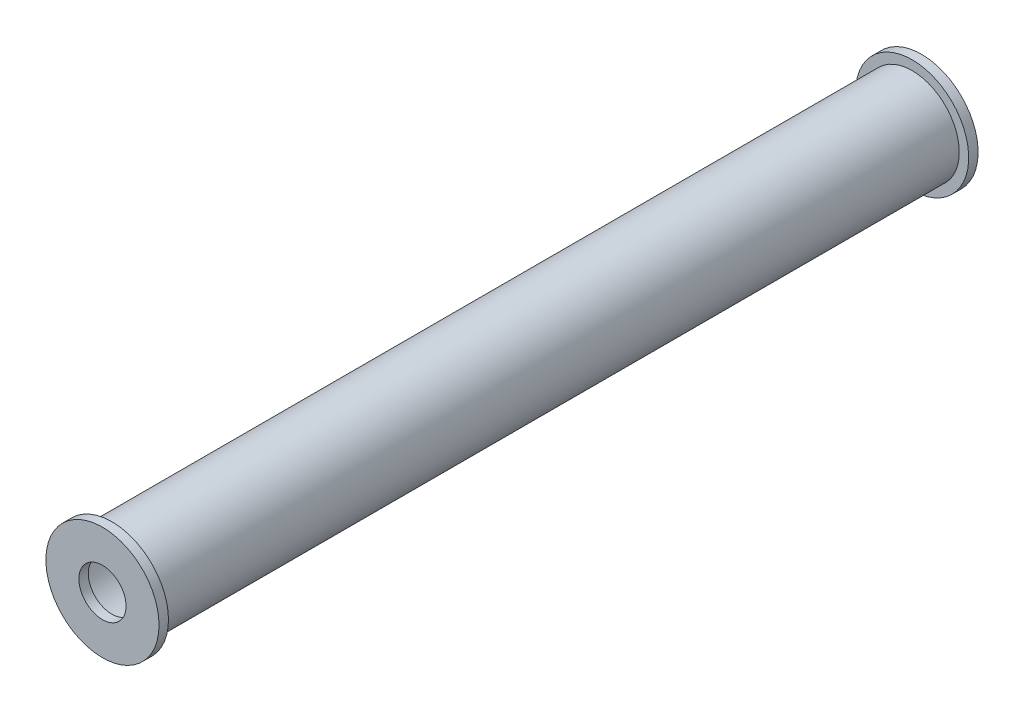
ISO-10303-21;
HEADER;
FILE_DESCRIPTION(('STEP AP214'),'2;1');
FILE_NAME('part.step','',(''),(''),'','','');
FILE_SCHEMA(('AUTOMOTIVE_DESIGN { 1 0 10303 214 1 1 1 1 }'));
ENDSEC;
DATA;
#1=APPLICATION_CONTEXT('core data for automotive mechanical design processes');
#2=APPLICATION_PROTOCOL_DEFINITION('international standard','automotive_design',2000,#1);
#3=PRODUCT_CONTEXT('',#1,'mechanical');
#4=PRODUCT('Part','Part','',(#3));
#5=PRODUCT_RELATED_PRODUCT_CATEGORY('part','',(#4));
#6=PRODUCT_DEFINITION_FORMATION('','',#4);
#7=PRODUCT_DEFINITION_CONTEXT('part definition',#1,'design');
#8=PRODUCT_DEFINITION('design','',#6,#7);
#9=PRODUCT_DEFINITION_SHAPE('','',#8);
#10=(LENGTH_UNIT() NAMED_UNIT(*) SI_UNIT(.MILLI.,.METRE.));
#11=(NAMED_UNIT(*) PLANE_ANGLE_UNIT() SI_UNIT($,.RADIAN.));
#12=(NAMED_UNIT(*) SI_UNIT($,.STERADIAN.) SOLID_ANGLE_UNIT());
#13=UNCERTAINTY_MEASURE_WITH_UNIT(LENGTH_MEASURE(1.E-05),#10,'distance_accuracy_value','');
#14=(GEOMETRIC_REPRESENTATION_CONTEXT(3) GLOBAL_UNCERTAINTY_ASSIGNED_CONTEXT((#13)) GLOBAL_UNIT_ASSIGNED_CONTEXT((#10,
#11,#12)) REPRESENTATION_CONTEXT('',''));
#15=CARTESIAN_POINT('',(0.,0.,0.));
#16=DIRECTION('',(0.,0.,1.));
#17=DIRECTION('',(1.,0.,0.));
#18=AXIS2_PLACEMENT_3D('',#15,#16,#17);
#19=CARTESIAN_POINT('',(0.,0.,84.88));
#20=DIRECTION('',(0.,0.,-1.));
#21=DIRECTION('',(-1.,0.,0.));
#22=AXIS2_PLACEMENT_3D('',#19,#20,#21);
#23=CYLINDRICAL_SURFACE('',#22,5.);
#24=CARTESIAN_POINT('',(0.,0.,84.88));
#25=DIRECTION('',(0.,0.,1.));
#26=DIRECTION('',(1.,0.,0.));
#27=AXIS2_PLACEMENT_3D('',#24,#25,#26);
#28=CIRCLE('',#27,5.);
#29=CARTESIAN_POINT('',(5.,0.,84.88));
#30=VERTEX_POINT('',#29);
#31=EDGE_CURVE('E10',#30,#30,#28,.T.);
#32=ORIENTED_EDGE('',*,*,#31,.F.);
#33=EDGE_LOOP('',(#32));
#34=FACE_BOUND('',#33,.T.);
#35=CARTESIAN_POINT('',(0.,0.,0.));
#36=DIRECTION('',(0.,0.,1.));
#37=DIRECTION('',(1.,0.,0.));
#38=AXIS2_PLACEMENT_3D('',#35,#36,#37);
#39=CIRCLE('',#38,5.);
#40=CARTESIAN_POINT('',(5.,0.,0.));
#41=VERTEX_POINT('',#40);
#42=EDGE_CURVE('E40',#41,#41,#39,.T.);
#43=ORIENTED_EDGE('',*,*,#42,.T.);
#44=EDGE_LOOP('',(#43));
#45=FACE_BOUND('',#44,.T.);
#46=ADVANCED_FACE('F37',(#34,#45),#23,.T.);
#47=CARTESIAN_POINT('',(0.,0.,84.88));
#48=DIRECTION('',(0.,0.,-1.));
#49=DIRECTION('',(-1.,0.,0.));
#50=AXIS2_PLACEMENT_3D('',#47,#48,#49);
#51=CYLINDRICAL_SURFACE('',#50,4.5);
#52=CARTESIAN_POINT('',(0.,0.,84.88));
#53=DIRECTION('',(0.,0.,1.));
#54=DIRECTION('',(1.,0.,0.));
#55=AXIS2_PLACEMENT_3D('',#52,#53,#54);
#56=CIRCLE('',#55,4.5);
#57=CARTESIAN_POINT('',(4.5,0.,84.88));
#58=VERTEX_POINT('',#57);
#59=EDGE_CURVE('E52',#58,#58,#56,.T.);
#60=ORIENTED_EDGE('',*,*,#59,.T.);
#61=EDGE_LOOP('',(#60));
#62=FACE_BOUND('',#61,.T.);
#63=CARTESIAN_POINT('',(0.,0.,0.));
#64=DIRECTION('',(0.,0.,1.));
#65=DIRECTION('',(1.,0.,0.));
#66=AXIS2_PLACEMENT_3D('',#63,#64,#65);
#67=CIRCLE('',#66,4.5);
#68=CARTESIAN_POINT('',(4.5,0.,0.));
#69=VERTEX_POINT('',#68);
#70=EDGE_CURVE('E45',#69,#69,#67,.T.);
#71=ORIENTED_EDGE('',*,*,#70,.F.);
#72=EDGE_LOOP('',(#71));
#73=FACE_BOUND('',#72,.T.);
#74=ADVANCED_FACE('F108',(#62,#73),#51,.F.);
#75=CARTESIAN_POINT('',(0.,0.,0.));
#76=DIRECTION('',(0.,0.,-1.));
#77=DIRECTION('',(-1.,0.,0.));
#78=AXIS2_PLACEMENT_3D('',#75,#76,#77);
#79=PLANE('',#78);
#80=CARTESIAN_POINT('',(0.,0.,0.));
#81=DIRECTION('',(0.,0.,-1.));
#82=DIRECTION('',(-1.,0.,0.));
#83=AXIS2_PLACEMENT_3D('',#80,#81,#82);
#84=CIRCLE('',#83,2.5);
#85=CARTESIAN_POINT('',(-2.5,0.,0.));
#86=VERTEX_POINT('',#85);
#87=EDGE_CURVE('E56',#86,#86,#84,.T.);
#88=ORIENTED_EDGE('',*,*,#87,.T.);
#89=EDGE_LOOP('',(#88));
#90=FACE_BOUND('',#89,.T.);
#91=ORIENTED_EDGE('',*,*,#70,.T.);
#92=EDGE_LOOP('',(#91));
#93=FACE_BOUND('',#92,.T.);
#94=ADVANCED_FACE('F113',(#90,#93),#79,.F.);
#95=CARTESIAN_POINT('',(0.,0.,-1.));
#96=DIRECTION('',(0.,0.,-1.));
#97=DIRECTION('',(-1.,0.,0.));
#98=AXIS2_PLACEMENT_3D('',#95,#96,#97);
#99=PLANE('',#98);
#100=CARTESIAN_POINT('',(0.,0.,-1.));
#101=DIRECTION('',(0.,0.,-1.));
#102=DIRECTION('',(-1.,0.,0.));
#103=AXIS2_PLACEMENT_3D('',#100,#101,#102);
#104=CIRCLE('',#103,6.);
#105=CARTESIAN_POINT('',(-6.,0.,-1.));
#106=VERTEX_POINT('',#105);
#107=EDGE_CURVE('E62',#106,#106,#104,.T.);
#108=ORIENTED_EDGE('',*,*,#107,.T.);
#109=EDGE_LOOP('',(#108));
#110=FACE_BOUND('',#109,.T.);
#111=CARTESIAN_POINT('',(0.,0.,-1.));
#112=DIRECTION('',(0.,0.,-1.));
#113=DIRECTION('',(-1.,0.,0.));
#114=AXIS2_PLACEMENT_3D('',#111,#112,#113);
#115=CIRCLE('',#114,2.5);
#116=CARTESIAN_POINT('',(-2.5,0.,-1.));
#117=VERTEX_POINT('',#116);
#118=EDGE_CURVE('E63',#117,#117,#115,.T.);
#119=ORIENTED_EDGE('',*,*,#118,.F.);
#120=EDGE_LOOP('',(#119));
#121=FACE_BOUND('',#120,.T.);
#122=ADVANCED_FACE('F124',(#110,#121),#99,.T.);
#123=ORIENTED_EDGE('',*,*,#42,.F.);
#124=EDGE_LOOP('',(#123));
#125=FACE_BOUND('',#124,.T.);
#126=CARTESIAN_POINT('',(0.,0.,0.));
#127=DIRECTION('',(0.,0.,-1.));
#128=DIRECTION('',(-1.,0.,0.));
#129=AXIS2_PLACEMENT_3D('',#126,#127,#128);
#130=CIRCLE('',#129,6.);
#131=CARTESIAN_POINT('',(-6.,0.,0.));
#132=VERTEX_POINT('',#131);
#133=EDGE_CURVE('E58',#132,#132,#130,.T.);
#134=ORIENTED_EDGE('',*,*,#133,.F.);
#135=EDGE_LOOP('',(#134));
#136=FACE_BOUND('',#135,.T.);
#137=ADVANCED_FACE('F120',(#125,#136),#79,.F.);
#138=CARTESIAN_POINT('',(0.,0.,-1.));
#139=DIRECTION('',(0.,0.,1.));
#140=DIRECTION('',(1.,0.,0.));
#141=AXIS2_PLACEMENT_3D('',#138,#139,#140);
#142=CYLINDRICAL_SURFACE('',#141,6.);
#143=ORIENTED_EDGE('',*,*,#107,.F.);
#144=EDGE_LOOP('',(#143));
#145=FACE_BOUND('',#144,.T.);
#146=ORIENTED_EDGE('',*,*,#133,.T.);
#147=EDGE_LOOP('',(#146));
#148=FACE_BOUND('',#147,.T.);
#149=ADVANCED_FACE('F123',(#145,#148),#142,.T.);
#150=CARTESIAN_POINT('',(0.,0.,-1.));
#151=DIRECTION('',(0.,0.,1.));
#152=DIRECTION('',(1.,0.,0.));
#153=AXIS2_PLACEMENT_3D('',#150,#151,#152);
#154=CYLINDRICAL_SURFACE('',#153,2.5);
#155=ORIENTED_EDGE('',*,*,#118,.T.);
#156=EDGE_LOOP('',(#155));
#157=FACE_BOUND('',#156,.T.);
#158=ORIENTED_EDGE('',*,*,#87,.F.);
#159=EDGE_LOOP('',(#158));
#160=FACE_BOUND('',#159,.T.);
#161=ADVANCED_FACE('F104',(#157,#160),#154,.F.);
#162=CARTESIAN_POINT('',(0.,0.,84.88));
#163=DIRECTION('',(0.,0.,1.));
#164=DIRECTION('',(1.,0.,0.));
#165=AXIS2_PLACEMENT_3D('',#162,#163,#164);
#166=PLANE('',#165);
#167=CARTESIAN_POINT('',(0.,0.,84.88));
#168=DIRECTION('',(0.,0.,1.));
#169=DIRECTION('',(1.,0.,0.));
#170=AXIS2_PLACEMENT_3D('',#167,#168,#169);
#171=CIRCLE('',#170,2.5);
#172=CARTESIAN_POINT('',(2.5,0.,84.88));
#173=VERTEX_POINT('',#172);
#174=EDGE_CURVE('E81',#173,#173,#171,.T.);
#175=ORIENTED_EDGE('',*,*,#174,.T.);
#176=EDGE_LOOP('',(#175));
#177=FACE_BOUND('',#176,.T.);
#178=ORIENTED_EDGE('',*,*,#59,.F.);
#179=EDGE_LOOP('',(#178));
#180=FACE_BOUND('',#179,.T.);
#181=ADVANCED_FACE('F95',(#177,#180),#166,.F.);
#182=CARTESIAN_POINT('',(0.,0.,85.88));
#183=DIRECTION('',(0.,0.,1.));
#184=DIRECTION('',(1.,0.,0.));
#185=AXIS2_PLACEMENT_3D('',#182,#183,#184);
#186=PLANE('',#185);
#187=CARTESIAN_POINT('',(0.,0.,85.88));
#188=DIRECTION('',(0.,0.,1.));
#189=DIRECTION('',(1.,0.,0.));
#190=AXIS2_PLACEMENT_3D('',#187,#188,#189);
#191=CIRCLE('',#190,6.);
#192=CARTESIAN_POINT('',(6.,0.,85.88));
#193=VERTEX_POINT('',#192);
#194=EDGE_CURVE('E57',#193,#193,#191,.T.);
#195=ORIENTED_EDGE('',*,*,#194,.T.);
#196=EDGE_LOOP('',(#195));
#197=FACE_BOUND('',#196,.T.);
#198=CARTESIAN_POINT('',(0.,0.,85.88));
#199=DIRECTION('',(0.,0.,1.));
#200=DIRECTION('',(1.,0.,0.));
#201=AXIS2_PLACEMENT_3D('',#198,#199,#200);
#202=CIRCLE('',#201,2.5);
#203=CARTESIAN_POINT('',(2.5,0.,85.88));
#204=VERTEX_POINT('',#203);
#205=EDGE_CURVE('E77',#204,#204,#202,.T.);
#206=ORIENTED_EDGE('',*,*,#205,.F.);
#207=EDGE_LOOP('',(#206));
#208=FACE_BOUND('',#207,.T.);
#209=ADVANCED_FACE('F92',(#197,#208),#186,.T.);
#210=ORIENTED_EDGE('',*,*,#31,.T.);
#211=EDGE_LOOP('',(#210));
#212=FACE_BOUND('',#211,.T.);
#213=CARTESIAN_POINT('',(0.,0.,84.88));
#214=DIRECTION('',(0.,0.,1.));
#215=DIRECTION('',(1.,0.,0.));
#216=AXIS2_PLACEMENT_3D('',#213,#214,#215);
#217=CIRCLE('',#216,6.);
#218=CARTESIAN_POINT('',(6.,0.,84.88));
#219=VERTEX_POINT('',#218);
#220=EDGE_CURVE('E73',#219,#219,#217,.T.);
#221=ORIENTED_EDGE('',*,*,#220,.F.);
#222=EDGE_LOOP('',(#221));
#223=FACE_BOUND('',#222,.T.);
#224=ADVANCED_FACE('F94',(#212,#223),#166,.F.);
#225=CARTESIAN_POINT('',(0.,0.,85.88));
#226=DIRECTION('',(0.,0.,-1.));
#227=DIRECTION('',(-1.,0.,0.));
#228=AXIS2_PLACEMENT_3D('',#225,#226,#227);
#229=CYLINDRICAL_SURFACE('',#228,6.);
#230=ORIENTED_EDGE('',*,*,#194,.F.);
#231=EDGE_LOOP('',(#230));
#232=FACE_BOUND('',#231,.T.);
#233=ORIENTED_EDGE('',*,*,#220,.T.);
#234=EDGE_LOOP('',(#233));
#235=FACE_BOUND('',#234,.T.);
#236=ADVANCED_FACE('F102',(#232,#235),#229,.T.);
#237=CARTESIAN_POINT('',(0.,0.,85.88));
#238=DIRECTION('',(0.,0.,-1.));
#239=DIRECTION('',(-1.,0.,0.));
#240=AXIS2_PLACEMENT_3D('',#237,#238,#239);
#241=CYLINDRICAL_SURFACE('',#240,2.5);
#242=ORIENTED_EDGE('',*,*,#205,.T.);
#243=EDGE_LOOP('',(#242));
#244=FACE_BOUND('',#243,.T.);
#245=ORIENTED_EDGE('',*,*,#174,.F.);
#246=EDGE_LOOP('',(#245));
#247=FACE_BOUND('',#246,.T.);
#248=ADVANCED_FACE('F89',(#244,#247),#241,.F.);
#249=CLOSED_SHELL('',(#46,#74,#94,#122,#137,#149,#161,#181,#209,#224,#236,#248));
#250=MANIFOLD_SOLID_BREP('B2',#249);
#251=ADVANCED_BREP_SHAPE_REPRESENTATION('',(#18,#250),#14);
#252=SHAPE_DEFINITION_REPRESENTATION(#9,#251);
ENDSEC;
END-ISO-10303-21;
